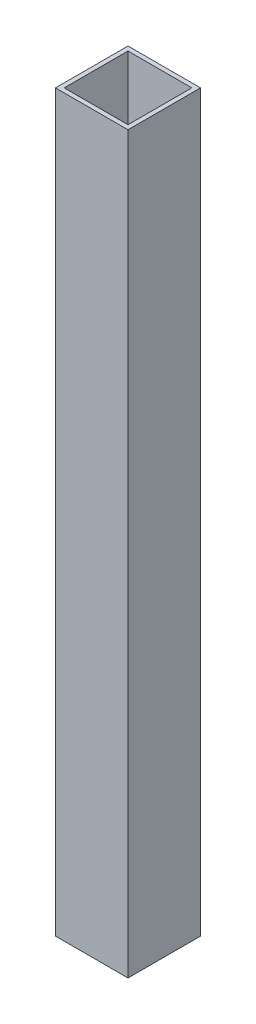
ISO-10303-21;
HEADER;
FILE_DESCRIPTION(('STEP AP214'),'2;1');
FILE_NAME('part.step','',(''),(''),'','','');
FILE_SCHEMA(('AUTOMOTIVE_DESIGN { 1 0 10303 214 1 1 1 1 }'));
ENDSEC;
DATA;
#1=APPLICATION_CONTEXT('core data for automotive mechanical design processes');
#2=APPLICATION_PROTOCOL_DEFINITION('international standard','automotive_design',2000,#1);
#3=PRODUCT_CONTEXT('',#1,'mechanical');
#4=PRODUCT('Part','Part','',(#3));
#5=PRODUCT_RELATED_PRODUCT_CATEGORY('part','',(#4));
#6=PRODUCT_DEFINITION_FORMATION('','',#4);
#7=PRODUCT_DEFINITION_CONTEXT('part definition',#1,'design');
#8=PRODUCT_DEFINITION('design','',#6,#7);
#9=PRODUCT_DEFINITION_SHAPE('','',#8);
#10=(LENGTH_UNIT() NAMED_UNIT(*) SI_UNIT(.MILLI.,.METRE.));
#11=(NAMED_UNIT(*) PLANE_ANGLE_UNIT() SI_UNIT($,.RADIAN.));
#12=(NAMED_UNIT(*) SI_UNIT($,.STERADIAN.) SOLID_ANGLE_UNIT());
#13=UNCERTAINTY_MEASURE_WITH_UNIT(LENGTH_MEASURE(1.E-05),#10,'distance_accuracy_value','');
#14=(GEOMETRIC_REPRESENTATION_CONTEXT(3) GLOBAL_UNCERTAINTY_ASSIGNED_CONTEXT((#13)) GLOBAL_UNIT_ASSIGNED_CONTEXT((#10,
#11,#12)) REPRESENTATION_CONTEXT('',''));
#15=CARTESIAN_POINT('',(0.,0.,0.));
#16=DIRECTION('',(0.,0.,1.));
#17=DIRECTION('',(1.,0.,0.));
#18=AXIS2_PLACEMENT_3D('',#15,#16,#17);
#19=CARTESIAN_POINT('',(0.,506.49,0.));
#20=DIRECTION('',(0.,-1.,0.));
#21=DIRECTION('',(0.,0.,-1.));
#22=AXIS2_PLACEMENT_3D('',#19,#20,#21);
#23=PLANE('',#22);
#24=DIRECTION('',(0.,0.,-1.));
#25=VECTOR('',#24,1.);
#26=CARTESIAN_POINT('',(19.1485920230207,506.49,15.));
#27=LINE('',#26,#25);
#28=CARTESIAN_POINT('',(19.1485920230207,506.49,15.));
#29=VERTEX_POINT('',#28);
#30=CARTESIAN_POINT('',(19.1485920230207,506.49,-35.));
#31=VERTEX_POINT('',#30);
#32=EDGE_CURVE('E135',#29,#31,#27,.T.);
#33=ORIENTED_EDGE('',*,*,#32,.T.);
#34=DIRECTION('',(-1.,0.,0.));
#35=VECTOR('',#34,1.);
#36=CARTESIAN_POINT('',(-30.8514079769793,506.49,-35.));
#37=LINE('',#36,#35);
#38=CARTESIAN_POINT('',(-30.8514079769793,506.49,-35.));
#39=VERTEX_POINT('',#38);
#40=EDGE_CURVE('E138',#31,#39,#37,.T.);
#41=ORIENTED_EDGE('',*,*,#40,.T.);
#42=DIRECTION('',(0.,0.,1.));
#43=VECTOR('',#42,1.);
#44=CARTESIAN_POINT('',(-30.8514079769793,506.49,15.));
#45=LINE('',#44,#43);
#46=CARTESIAN_POINT('',(-30.8514079769793,506.49,15.));
#47=VERTEX_POINT('',#46);
#48=EDGE_CURVE('E141',#39,#47,#45,.T.);
#49=ORIENTED_EDGE('',*,*,#48,.T.);
#50=DIRECTION('',(1.,0.,0.));
#51=VECTOR('',#50,1.);
#52=CARTESIAN_POINT('',(-30.8514079769793,506.49,15.));
#53=LINE('',#52,#51);
#54=EDGE_CURVE('E143',#47,#29,#53,.T.);
#55=ORIENTED_EDGE('',*,*,#54,.T.);
#56=EDGE_LOOP('',(#33,#41,#49,#55));
#57=FACE_BOUND('',#56,.T.);
#58=DIRECTION('',(0.,0.,1.));
#59=VECTOR('',#58,1.);
#60=CARTESIAN_POINT('',(-27.8514079769793,506.49,12.));
#61=LINE('',#60,#59);
#62=CARTESIAN_POINT('',(-27.8514079769793,506.49,-32.));
#63=VERTEX_POINT('',#62);
#64=CARTESIAN_POINT('',(-27.8514079769793,506.49,12.));
#65=VERTEX_POINT('',#64);
#66=EDGE_CURVE('E99',#63,#65,#61,.T.);
#67=ORIENTED_EDGE('',*,*,#66,.F.);
#68=DIRECTION('',(-1.,0.,0.));
#69=VECTOR('',#68,1.);
#70=CARTESIAN_POINT('',(-27.8514079769793,506.49,-32.));
#71=LINE('',#70,#69);
#72=CARTESIAN_POINT('',(16.1485920230207,506.49,-32.));
#73=VERTEX_POINT('',#72);
#74=EDGE_CURVE('E121',#73,#63,#71,.T.);
#75=ORIENTED_EDGE('',*,*,#74,.F.);
#76=DIRECTION('',(0.,0.,-1.));
#77=VECTOR('',#76,1.);
#78=CARTESIAN_POINT('',(16.1485920230207,506.49,12.));
#79=LINE('',#78,#77);
#80=CARTESIAN_POINT('',(16.1485920230207,506.49,12.));
#81=VERTEX_POINT('',#80);
#82=EDGE_CURVE('E119',#81,#73,#79,.T.);
#83=ORIENTED_EDGE('',*,*,#82,.F.);
#84=DIRECTION('',(1.,0.,0.));
#85=VECTOR('',#84,1.);
#86=CARTESIAN_POINT('',(-27.8514079769793,506.49,12.));
#87=LINE('',#86,#85);
#88=EDGE_CURVE('E107',#65,#81,#87,.T.);
#89=ORIENTED_EDGE('',*,*,#88,.F.);
#90=EDGE_LOOP('',(#67,#75,#83,#89));
#91=FACE_BOUND('',#90,.T.);
#92=ADVANCED_FACE('F34',(#57,#91),#23,.F.);
#93=CARTESIAN_POINT('',(0.,0.,0.));
#94=DIRECTION('',(0.,-1.,0.));
#95=DIRECTION('',(0.,0.,-1.));
#96=AXIS2_PLACEMENT_3D('',#93,#94,#95);
#97=PLANE('',#96);
#98=DIRECTION('',(0.,0.,-1.));
#99=VECTOR('',#98,1.);
#100=CARTESIAN_POINT('',(19.1485920230207,0.,15.));
#101=LINE('',#100,#99);
#102=CARTESIAN_POINT('',(19.1485920230207,0.,15.));
#103=VERTEX_POINT('',#102);
#104=CARTESIAN_POINT('',(19.1485920230207,0.,-35.));
#105=VERTEX_POINT('',#104);
#106=EDGE_CURVE('E115',#103,#105,#101,.T.);
#107=ORIENTED_EDGE('',*,*,#106,.F.);
#108=DIRECTION('',(1.,0.,0.));
#109=VECTOR('',#108,1.);
#110=CARTESIAN_POINT('',(-30.8514079769793,0.,15.));
#111=LINE('',#110,#109);
#112=CARTESIAN_POINT('',(-30.8514079769793,0.,15.));
#113=VERTEX_POINT('',#112);
#114=EDGE_CURVE('E139',#113,#103,#111,.T.);
#115=ORIENTED_EDGE('',*,*,#114,.F.);
#116=DIRECTION('',(0.,0.,1.));
#117=VECTOR('',#116,1.);
#118=CARTESIAN_POINT('',(-30.8514079769793,0.,15.));
#119=LINE('',#118,#117);
#120=CARTESIAN_POINT('',(-30.8514079769793,0.,-35.));
#121=VERTEX_POINT('',#120);
#122=EDGE_CURVE('E150',#121,#113,#119,.T.);
#123=ORIENTED_EDGE('',*,*,#122,.F.);
#124=DIRECTION('',(-1.,0.,0.));
#125=VECTOR('',#124,1.);
#126=CARTESIAN_POINT('',(-30.8514079769793,0.,-35.));
#127=LINE('',#126,#125);
#128=EDGE_CURVE('E148',#105,#121,#127,.T.);
#129=ORIENTED_EDGE('',*,*,#128,.F.);
#130=EDGE_LOOP('',(#107,#115,#123,#129));
#131=FACE_BOUND('',#130,.T.);
#132=DIRECTION('',(-1.,0.,0.));
#133=VECTOR('',#132,1.);
#134=CARTESIAN_POINT('',(-27.8514079769793,0.,-32.));
#135=LINE('',#134,#133);
#136=CARTESIAN_POINT('',(16.1485920230207,0.,-32.));
#137=VERTEX_POINT('',#136);
#138=CARTESIAN_POINT('',(-27.8514079769793,0.,-32.));
#139=VERTEX_POINT('',#138);
#140=EDGE_CURVE('E108',#137,#139,#135,.T.);
#141=ORIENTED_EDGE('',*,*,#140,.T.);
#142=DIRECTION('',(0.,0.,1.));
#143=VECTOR('',#142,1.);
#144=CARTESIAN_POINT('',(-27.8514079769793,0.,12.));
#145=LINE('',#144,#143);
#146=CARTESIAN_POINT('',(-27.8514079769793,0.,12.));
#147=VERTEX_POINT('',#146);
#148=EDGE_CURVE('E57',#139,#147,#145,.T.);
#149=ORIENTED_EDGE('',*,*,#148,.T.);
#150=DIRECTION('',(1.,0.,0.));
#151=VECTOR('',#150,1.);
#152=CARTESIAN_POINT('',(-27.8514079769793,0.,12.));
#153=LINE('',#152,#151);
#154=CARTESIAN_POINT('',(16.1485920230207,0.,12.));
#155=VERTEX_POINT('',#154);
#156=EDGE_CURVE('E114',#147,#155,#153,.T.);
#157=ORIENTED_EDGE('',*,*,#156,.T.);
#158=DIRECTION('',(0.,0.,-1.));
#159=VECTOR('',#158,1.);
#160=CARTESIAN_POINT('',(16.1485920230207,0.,12.));
#161=LINE('',#160,#159);
#162=EDGE_CURVE('E127',#155,#137,#161,.T.);
#163=ORIENTED_EDGE('',*,*,#162,.T.);
#164=EDGE_LOOP('',(#141,#149,#157,#163));
#165=FACE_BOUND('',#164,.T.);
#166=ADVANCED_FACE('F168',(#131,#165),#97,.T.);
#167=CARTESIAN_POINT('',(19.1485920230207,506.49,15.));
#168=DIRECTION('',(-1.,0.,0.));
#169=DIRECTION('',(0.,0.,1.));
#170=AXIS2_PLACEMENT_3D('',#167,#168,#169);
#171=PLANE('',#170);
#172=ORIENTED_EDGE('',*,*,#106,.T.);
#173=DIRECTION('',(0.,-1.,0.));
#174=VECTOR('',#173,1.);
#175=CARTESIAN_POINT('',(19.1485920230207,506.49,-35.));
#176=LINE('',#175,#174);
#177=EDGE_CURVE('E11',#31,#105,#176,.T.);
#178=ORIENTED_EDGE('',*,*,#177,.F.);
#179=ORIENTED_EDGE('',*,*,#32,.F.);
#180=DIRECTION('',(0.,-1.,0.));
#181=VECTOR('',#180,1.);
#182=CARTESIAN_POINT('',(19.1485920230207,506.49,15.));
#183=LINE('',#182,#181);
#184=EDGE_CURVE('E145',#29,#103,#183,.T.);
#185=ORIENTED_EDGE('',*,*,#184,.T.);
#186=EDGE_LOOP('',(#172,#178,#179,#185));
#187=FACE_BOUND('',#186,.T.);
#188=ADVANCED_FACE('F36',(#187),#171,.F.);
#189=CARTESIAN_POINT('',(-30.8514079769793,506.49,-35.));
#190=DIRECTION('',(0.,0.,1.));
#191=DIRECTION('',(1.,0.,0.));
#192=AXIS2_PLACEMENT_3D('',#189,#190,#191);
#193=PLANE('',#192);
#194=ORIENTED_EDGE('',*,*,#128,.T.);
#195=DIRECTION('',(0.,-1.,0.));
#196=VECTOR('',#195,1.);
#197=CARTESIAN_POINT('',(-30.8514079769793,506.49,-35.));
#198=LINE('',#197,#196);
#199=EDGE_CURVE('E42',#39,#121,#198,.T.);
#200=ORIENTED_EDGE('',*,*,#199,.F.);
#201=ORIENTED_EDGE('',*,*,#40,.F.);
#202=ORIENTED_EDGE('',*,*,#177,.T.);
#203=EDGE_LOOP('',(#194,#200,#201,#202));
#204=FACE_BOUND('',#203,.T.);
#205=ADVANCED_FACE('F178',(#204),#193,.F.);
#206=CARTESIAN_POINT('',(-30.8514079769793,506.49,15.));
#207=DIRECTION('',(1.,0.,0.));
#208=DIRECTION('',(0.,0.,-1.));
#209=AXIS2_PLACEMENT_3D('',#206,#207,#208);
#210=PLANE('',#209);
#211=ORIENTED_EDGE('',*,*,#122,.T.);
#212=DIRECTION('',(0.,-1.,0.));
#213=VECTOR('',#212,1.);
#214=CARTESIAN_POINT('',(-30.8514079769793,506.49,15.));
#215=LINE('',#214,#213);
#216=EDGE_CURVE('E155',#47,#113,#215,.T.);
#217=ORIENTED_EDGE('',*,*,#216,.F.);
#218=ORIENTED_EDGE('',*,*,#48,.F.);
#219=ORIENTED_EDGE('',*,*,#199,.T.);
#220=EDGE_LOOP('',(#211,#217,#218,#219));
#221=FACE_BOUND('',#220,.T.);
#222=ADVANCED_FACE('F162',(#221),#210,.F.);
#223=CARTESIAN_POINT('',(-30.8514079769793,506.49,15.));
#224=DIRECTION('',(0.,0.,-1.));
#225=DIRECTION('',(-1.,0.,0.));
#226=AXIS2_PLACEMENT_3D('',#223,#224,#225);
#227=PLANE('',#226);
#228=ORIENTED_EDGE('',*,*,#114,.T.);
#229=ORIENTED_EDGE('',*,*,#184,.F.);
#230=ORIENTED_EDGE('',*,*,#54,.F.);
#231=ORIENTED_EDGE('',*,*,#216,.T.);
#232=EDGE_LOOP('',(#228,#229,#230,#231));
#233=FACE_BOUND('',#232,.T.);
#234=ADVANCED_FACE('F172',(#233),#227,.F.);
#235=CARTESIAN_POINT('',(-27.8514079769793,506.49,12.));
#236=DIRECTION('',(1.,0.,0.));
#237=DIRECTION('',(0.,0.,-1.));
#238=AXIS2_PLACEMENT_3D('',#235,#236,#237);
#239=PLANE('',#238);
#240=ORIENTED_EDGE('',*,*,#148,.F.);
#241=DIRECTION('',(0.,-1.,0.));
#242=VECTOR('',#241,1.);
#243=CARTESIAN_POINT('',(-27.8514079769793,506.49,-32.));
#244=LINE('',#243,#242);
#245=EDGE_CURVE('E103',#63,#139,#244,.T.);
#246=ORIENTED_EDGE('',*,*,#245,.F.);
#247=ORIENTED_EDGE('',*,*,#66,.T.);
#248=DIRECTION('',(0.,-1.,0.));
#249=VECTOR('',#248,1.);
#250=CARTESIAN_POINT('',(-27.8514079769793,506.49,12.));
#251=LINE('',#250,#249);
#252=EDGE_CURVE('E102',#65,#147,#251,.T.);
#253=ORIENTED_EDGE('',*,*,#252,.T.);
#254=EDGE_LOOP('',(#240,#246,#247,#253));
#255=FACE_BOUND('',#254,.T.);
#256=ADVANCED_FACE('F101',(#255),#239,.T.);
#257=CARTESIAN_POINT('',(-27.8514079769793,506.49,12.));
#258=DIRECTION('',(0.,0.,-1.));
#259=DIRECTION('',(-1.,0.,0.));
#260=AXIS2_PLACEMENT_3D('',#257,#258,#259);
#261=PLANE('',#260);
#262=ORIENTED_EDGE('',*,*,#156,.F.);
#263=ORIENTED_EDGE('',*,*,#252,.F.);
#264=ORIENTED_EDGE('',*,*,#88,.T.);
#265=DIRECTION('',(0.,-1.,0.));
#266=VECTOR('',#265,1.);
#267=CARTESIAN_POINT('',(16.1485920230207,506.49,12.));
#268=LINE('',#267,#266);
#269=EDGE_CURVE('E116',#81,#155,#268,.T.);
#270=ORIENTED_EDGE('',*,*,#269,.T.);
#271=EDGE_LOOP('',(#262,#263,#264,#270));
#272=FACE_BOUND('',#271,.T.);
#273=ADVANCED_FACE('F111',(#272),#261,.T.);
#274=CARTESIAN_POINT('',(16.1485920230207,506.49,12.));
#275=DIRECTION('',(-1.,0.,0.));
#276=DIRECTION('',(0.,0.,1.));
#277=AXIS2_PLACEMENT_3D('',#274,#275,#276);
#278=PLANE('',#277);
#279=ORIENTED_EDGE('',*,*,#162,.F.);
#280=ORIENTED_EDGE('',*,*,#269,.F.);
#281=ORIENTED_EDGE('',*,*,#82,.T.);
#282=DIRECTION('',(0.,-1.,0.));
#283=VECTOR('',#282,1.);
#284=CARTESIAN_POINT('',(16.1485920230207,506.49,-32.));
#285=LINE('',#284,#283);
#286=EDGE_CURVE('E49',#73,#137,#285,.T.);
#287=ORIENTED_EDGE('',*,*,#286,.T.);
#288=EDGE_LOOP('',(#279,#280,#281,#287));
#289=FACE_BOUND('',#288,.T.);
#290=ADVANCED_FACE('F201',(#289),#278,.T.);
#291=CARTESIAN_POINT('',(-27.8514079769793,506.49,-32.));
#292=DIRECTION('',(0.,0.,1.));
#293=DIRECTION('',(1.,0.,0.));
#294=AXIS2_PLACEMENT_3D('',#291,#292,#293);
#295=PLANE('',#294);
#296=ORIENTED_EDGE('',*,*,#140,.F.);
#297=ORIENTED_EDGE('',*,*,#286,.F.);
#298=ORIENTED_EDGE('',*,*,#74,.T.);
#299=ORIENTED_EDGE('',*,*,#245,.T.);
#300=EDGE_LOOP('',(#296,#297,#298,#299));
#301=FACE_BOUND('',#300,.T.);
#302=ADVANCED_FACE('F205',(#301),#295,.T.);
#303=CLOSED_SHELL('',(#92,#166,#188,#205,#222,#234,#256,#273,#290,#302));
#304=MANIFOLD_SOLID_BREP('B2',#303);
#305=ADVANCED_BREP_SHAPE_REPRESENTATION('',(#18,#304),#14);
#306=SHAPE_DEFINITION_REPRESENTATION(#9,#305);
ENDSEC;
END-ISO-10303-21;
